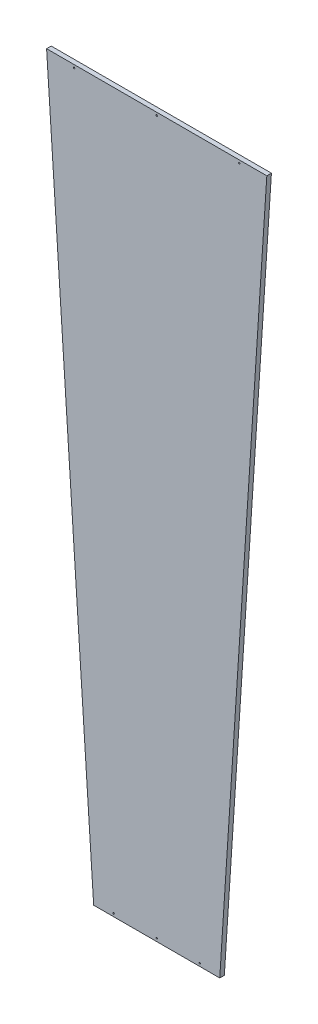
ISO-10303-21;
HEADER;
FILE_DESCRIPTION(('STEP AP214'),'2;1');
FILE_NAME('part.step','',(''),(''),'','','');
FILE_SCHEMA(('AUTOMOTIVE_DESIGN { 1 0 10303 214 1 1 1 1 }'));
ENDSEC;
DATA;
#1=APPLICATION_CONTEXT('core data for automotive mechanical design processes');
#2=APPLICATION_PROTOCOL_DEFINITION('international standard','automotive_design',2000,#1);
#3=PRODUCT_CONTEXT('',#1,'mechanical');
#4=PRODUCT('Part','Part','',(#3));
#5=PRODUCT_RELATED_PRODUCT_CATEGORY('part','',(#4));
#6=PRODUCT_DEFINITION_FORMATION('','',#4);
#7=PRODUCT_DEFINITION_CONTEXT('part definition',#1,'design');
#8=PRODUCT_DEFINITION('design','',#6,#7);
#9=PRODUCT_DEFINITION_SHAPE('','',#8);
#10=(LENGTH_UNIT() NAMED_UNIT(*) SI_UNIT(.MILLI.,.METRE.));
#11=(NAMED_UNIT(*) PLANE_ANGLE_UNIT() SI_UNIT($,.RADIAN.));
#12=(NAMED_UNIT(*) SI_UNIT($,.STERADIAN.) SOLID_ANGLE_UNIT());
#13=UNCERTAINTY_MEASURE_WITH_UNIT(LENGTH_MEASURE(1.E-05),#10,'distance_accuracy_value','');
#14=(GEOMETRIC_REPRESENTATION_CONTEXT(3) GLOBAL_UNCERTAINTY_ASSIGNED_CONTEXT((#13)) GLOBAL_UNIT_ASSIGNED_CONTEXT((#10,
#11,#12)) REPRESENTATION_CONTEXT('',''));
#15=CARTESIAN_POINT('',(0.,0.,0.));
#16=DIRECTION('',(0.,0.,1.));
#17=DIRECTION('',(1.,0.,0.));
#18=AXIS2_PLACEMENT_3D('',#15,#16,#17);
#19=CARTESIAN_POINT('',(-7.66326205582319,93.9841028384047,0.16));
#20=DIRECTION('',(-0.997858923238604,-0.0654031292301395,0.));
#21=DIRECTION('',(0.0654031292301396,-0.997858923238604,0.));
#22=AXIS2_PLACEMENT_3D('',#19,#20,#21);
#23=PLANE('',#22);
#24=DIRECTION('',(-0.0654031292301396,0.997858923238604,0.));
#25=VECTOR('',#24,1.);
#26=CARTESIAN_POINT('',(-7.66326205582319,93.9841028384047,-0.16));
#27=LINE('',#26,#25);
#28=CARTESIAN_POINT('',(-4.38700000000001,43.9980033084047,-0.16));
#29=VERTEX_POINT('',#28);
#30=CARTESIAN_POINT('',(-7.66326205582319,93.9841028384047,-0.16));
#31=VERTEX_POINT('',#30);
#32=EDGE_CURVE('E95',#29,#31,#27,.T.);
#33=ORIENTED_EDGE('',*,*,#32,.F.);
#34=DIRECTION('',(0.,0.,-1.));
#35=VECTOR('',#34,1.);
#36=CARTESIAN_POINT('',(-4.38700000000001,43.9980033084047,0.16));
#37=LINE('',#36,#35);
#38=CARTESIAN_POINT('',(-4.38700000000001,43.9980033084047,0.16));
#39=VERTEX_POINT('',#38);
#40=EDGE_CURVE('E11',#39,#29,#37,.T.);
#41=ORIENTED_EDGE('',*,*,#40,.F.);
#42=DIRECTION('',(-0.0654031292301396,0.997858923238604,0.));
#43=VECTOR('',#42,1.);
#44=CARTESIAN_POINT('',(-7.66326205582319,93.9841028384047,0.16));
#45=LINE('',#44,#43);
#46=CARTESIAN_POINT('',(-7.66326205582319,93.9841028384047,0.16));
#47=VERTEX_POINT('',#46);
#48=EDGE_CURVE('E88',#39,#47,#45,.T.);
#49=ORIENTED_EDGE('',*,*,#48,.T.);
#50=DIRECTION('',(0.,0.,-1.));
#51=VECTOR('',#50,1.);
#52=CARTESIAN_POINT('',(-7.66326205582319,93.9841028384047,0.16));
#53=LINE('',#52,#51);
#54=EDGE_CURVE('E33',#47,#31,#53,.T.);
#55=ORIENTED_EDGE('',*,*,#54,.T.);
#56=EDGE_LOOP('',(#33,#41,#49,#55));
#57=FACE_BOUND('',#56,.T.);
#58=ADVANCED_FACE('F30',(#57),#23,.T.);
#59=CARTESIAN_POINT('',(4.38699999999999,43.9980033084047,0.16));
#60=DIRECTION('',(0.,-1.,0.));
#61=DIRECTION('',(0.,0.,-1.));
#62=AXIS2_PLACEMENT_3D('',#59,#60,#61);
#63=PLANE('',#62);
#64=DIRECTION('',(-1.,0.,0.));
#65=VECTOR('',#64,1.);
#66=CARTESIAN_POINT('',(4.38699999999999,43.9980033084047,-0.16));
#67=LINE('',#66,#65);
#68=CARTESIAN_POINT('',(4.38699999999999,43.9980033084047,-0.16));
#69=VERTEX_POINT('',#68);
#70=EDGE_CURVE('E90',#69,#29,#67,.T.);
#71=ORIENTED_EDGE('',*,*,#70,.F.);
#72=DIRECTION('',(0.,0.,-1.));
#73=VECTOR('',#72,1.);
#74=CARTESIAN_POINT('',(4.38699999999999,43.9980033084047,0.16));
#75=LINE('',#74,#73);
#76=CARTESIAN_POINT('',(4.38699999999999,43.9980033084047,0.16));
#77=VERTEX_POINT('',#76);
#78=EDGE_CURVE('E39',#77,#69,#75,.T.);
#79=ORIENTED_EDGE('',*,*,#78,.F.);
#80=DIRECTION('',(-1.,0.,0.));
#81=VECTOR('',#80,1.);
#82=CARTESIAN_POINT('',(4.38699999999999,43.9980033084047,0.16));
#83=LINE('',#82,#81);
#84=EDGE_CURVE('E85',#77,#39,#83,.T.);
#85=ORIENTED_EDGE('',*,*,#84,.T.);
#86=ORIENTED_EDGE('',*,*,#40,.T.);
#87=EDGE_LOOP('',(#71,#79,#85,#86));
#88=FACE_BOUND('',#87,.T.);
#89=ADVANCED_FACE('F106',(#88),#63,.T.);
#90=CARTESIAN_POINT('',(7.66326205582318,93.9841028384047,0.16));
#91=DIRECTION('',(0.997858923238604,-0.0654031292301398,0.));
#92=DIRECTION('',(0.0654031292301398,0.997858923238604,0.));
#93=AXIS2_PLACEMENT_3D('',#90,#91,#92);
#94=PLANE('',#93);
#95=DIRECTION('',(-0.0654031292301398,-0.997858923238604,0.));
#96=VECTOR('',#95,1.);
#97=CARTESIAN_POINT('',(7.66326205582318,93.9841028384047,-0.16));
#98=LINE('',#97,#96);
#99=CARTESIAN_POINT('',(7.66326205582318,93.9841028384047,-0.16));
#100=VERTEX_POINT('',#99);
#101=EDGE_CURVE('E80',#100,#69,#98,.T.);
#102=ORIENTED_EDGE('',*,*,#101,.F.);
#103=DIRECTION('',(0.,0.,-1.));
#104=VECTOR('',#103,1.);
#105=CARTESIAN_POINT('',(7.66326205582318,93.9841028384047,0.16));
#106=LINE('',#105,#104);
#107=CARTESIAN_POINT('',(7.66326205582318,93.9841028384047,0.16));
#108=VERTEX_POINT('',#107);
#109=EDGE_CURVE('E75',#108,#100,#106,.T.);
#110=ORIENTED_EDGE('',*,*,#109,.F.);
#111=DIRECTION('',(-0.0654031292301398,-0.997858923238604,0.));
#112=VECTOR('',#111,1.);
#113=CARTESIAN_POINT('',(7.66326205582318,93.9841028384047,0.16));
#114=LINE('',#113,#112);
#115=EDGE_CURVE('E78',#108,#77,#114,.T.);
#116=ORIENTED_EDGE('',*,*,#115,.T.);
#117=ORIENTED_EDGE('',*,*,#78,.T.);
#118=EDGE_LOOP('',(#102,#110,#116,#117));
#119=FACE_BOUND('',#118,.T.);
#120=ADVANCED_FACE('F77',(#119),#94,.T.);
#121=CARTESIAN_POINT('',(-7.66326205582319,93.9841028384047,0.16));
#122=DIRECTION('',(0.,1.,0.));
#123=DIRECTION('',(0.,0.,1.));
#124=AXIS2_PLACEMENT_3D('',#121,#122,#123);
#125=PLANE('',#124);
#126=DIRECTION('',(1.,0.,0.));
#127=VECTOR('',#126,1.);
#128=CARTESIAN_POINT('',(-7.66326205582319,93.9841028384047,-0.16));
#129=LINE('',#128,#127);
#130=EDGE_CURVE('E98',#31,#100,#129,.T.);
#131=ORIENTED_EDGE('',*,*,#130,.F.);
#132=ORIENTED_EDGE('',*,*,#54,.F.);
#133=DIRECTION('',(1.,0.,0.));
#134=VECTOR('',#133,1.);
#135=CARTESIAN_POINT('',(-7.66326205582319,93.9841028384047,0.16));
#136=LINE('',#135,#134);
#137=EDGE_CURVE('E84',#47,#108,#136,.T.);
#138=ORIENTED_EDGE('',*,*,#137,.T.);
#139=ORIENTED_EDGE('',*,*,#109,.T.);
#140=EDGE_LOOP('',(#131,#132,#138,#139));
#141=FACE_BOUND('',#140,.T.);
#142=ADVANCED_FACE('F87',(#141),#125,.T.);
#143=CARTESIAN_POINT('',(-7.66326205582319,93.9841028384047,0.16));
#144=DIRECTION('',(0.,0.,1.));
#145=DIRECTION('',(1.,0.,0.));
#146=AXIS2_PLACEMENT_3D('',#143,#144,#145);
#147=PLANE('',#146);
#148=CARTESIAN_POINT('',(5.74639155524786,93.7841028384047,0.16));
#149=DIRECTION('',(0.,0.,1.));
#150=DIRECTION('',(1.,0.,0.));
#151=AXIS2_PLACEMENT_3D('',#148,#149,#150);
#152=CIRCLE('',#151,0.0499999999999898);
#153=CARTESIAN_POINT('',(5.79639155524785,93.7841028384047,0.16));
#154=VERTEX_POINT('',#153);
#155=EDGE_CURVE('E158',#154,#154,#152,.T.);
#156=ORIENTED_EDGE('',*,*,#155,.F.);
#157=EDGE_LOOP('',(#156));
#158=FACE_BOUND('',#157,.T.);
#159=CARTESIAN_POINT('',(0.,93.7841028384047,0.16));
#160=DIRECTION('',(0.,0.,1.));
#161=DIRECTION('',(1.,0.,0.));
#162=AXIS2_PLACEMENT_3D('',#159,#160,#161);
#163=CIRCLE('',#162,0.0499999999999943);
#164=CARTESIAN_POINT('',(0.0499999999999943,93.7841028384047,0.16));
#165=VERTEX_POINT('',#164);
#166=EDGE_CURVE('E160',#165,#165,#163,.T.);
#167=ORIENTED_EDGE('',*,*,#166,.F.);
#168=EDGE_LOOP('',(#167));
#169=FACE_BOUND('',#168,.T.);
#170=CARTESIAN_POINT('',(-5.74639155524786,93.7841028384047,0.16));
#171=DIRECTION('',(0.,0.,1.));
#172=DIRECTION('',(1.,0.,0.));
#173=AXIS2_PLACEMENT_3D('',#170,#171,#172);
#174=CIRCLE('',#173,0.0499999999999898);
#175=CARTESIAN_POINT('',(-5.69639155524787,93.7841028384047,0.16));
#176=VERTEX_POINT('',#175);
#177=EDGE_CURVE('E166',#176,#176,#174,.T.);
#178=ORIENTED_EDGE('',*,*,#177,.F.);
#179=EDGE_LOOP('',(#178));
#180=FACE_BOUND('',#179,.T.);
#181=CARTESIAN_POINT('',(3.,44.1980033084047,0.16));
#182=DIRECTION('',(0.,0.,1.));
#183=DIRECTION('',(1.,0.,0.));
#184=AXIS2_PLACEMENT_3D('',#181,#182,#183);
#185=CIRCLE('',#184,0.050000000000001);
#186=CARTESIAN_POINT('',(3.05,44.1980033084047,0.16));
#187=VERTEX_POINT('',#186);
#188=EDGE_CURVE('E172',#187,#187,#185,.T.);
#189=ORIENTED_EDGE('',*,*,#188,.F.);
#190=EDGE_LOOP('',(#189));
#191=FACE_BOUND('',#190,.T.);
#192=CARTESIAN_POINT('',(0.,44.1980033084047,0.16));
#193=DIRECTION('',(0.,0.,1.));
#194=DIRECTION('',(1.,0.,0.));
#195=AXIS2_PLACEMENT_3D('',#192,#193,#194);
#196=CIRCLE('',#195,0.0500000000000008);
#197=CARTESIAN_POINT('',(0.0500000000000008,44.1980033084047,0.16));
#198=VERTEX_POINT('',#197);
#199=EDGE_CURVE('E178',#198,#198,#196,.T.);
#200=ORIENTED_EDGE('',*,*,#199,.F.);
#201=EDGE_LOOP('',(#200));
#202=FACE_BOUND('',#201,.T.);
#203=CARTESIAN_POINT('',(-3.,44.1980033084047,0.16));
#204=DIRECTION('',(0.,0.,1.));
#205=DIRECTION('',(1.,0.,0.));
#206=AXIS2_PLACEMENT_3D('',#203,#204,#205);
#207=CIRCLE('',#206,0.050000000000001);
#208=CARTESIAN_POINT('',(-2.95,44.1980033084047,0.16));
#209=VERTEX_POINT('',#208);
#210=EDGE_CURVE('E184',#209,#209,#207,.T.);
#211=ORIENTED_EDGE('',*,*,#210,.F.);
#212=EDGE_LOOP('',(#211));
#213=FACE_BOUND('',#212,.T.);
#214=ORIENTED_EDGE('',*,*,#48,.F.);
#215=ORIENTED_EDGE('',*,*,#84,.F.);
#216=ORIENTED_EDGE('',*,*,#115,.F.);
#217=ORIENTED_EDGE('',*,*,#137,.F.);
#218=EDGE_LOOP('',(#214,#215,#216,#217));
#219=FACE_BOUND('',#218,.T.);
#220=ADVANCED_FACE('F83',(#158,#169,#180,#191,#202,#213,#219),#147,.T.);
#221=CARTESIAN_POINT('',(-7.66326205582319,93.9841028384047,-0.16));
#222=DIRECTION('',(0.,0.,1.));
#223=DIRECTION('',(1.,0.,0.));
#224=AXIS2_PLACEMENT_3D('',#221,#222,#223);
#225=PLANE('',#224);
#226=CARTESIAN_POINT('',(5.74639155524786,93.7841028384047,-0.16));
#227=DIRECTION('',(0.,0.,1.));
#228=DIRECTION('',(1.,0.,0.));
#229=AXIS2_PLACEMENT_3D('',#226,#227,#228);
#230=CIRCLE('',#229,0.0499999999999898);
#231=CARTESIAN_POINT('',(5.79639155524785,93.7841028384047,-0.16));
#232=VERTEX_POINT('',#231);
#233=EDGE_CURVE('E156',#232,#232,#230,.T.);
#234=ORIENTED_EDGE('',*,*,#233,.T.);
#235=EDGE_LOOP('',(#234));
#236=FACE_BOUND('',#235,.T.);
#237=CARTESIAN_POINT('',(0.,93.7841028384047,-0.16));
#238=DIRECTION('',(0.,0.,1.));
#239=DIRECTION('',(1.,0.,0.));
#240=AXIS2_PLACEMENT_3D('',#237,#238,#239);
#241=CIRCLE('',#240,0.0499999999999943);
#242=CARTESIAN_POINT('',(0.0499999999999943,93.7841028384047,-0.16));
#243=VERTEX_POINT('',#242);
#244=EDGE_CURVE('E163',#243,#243,#241,.T.);
#245=ORIENTED_EDGE('',*,*,#244,.T.);
#246=EDGE_LOOP('',(#245));
#247=FACE_BOUND('',#246,.T.);
#248=CARTESIAN_POINT('',(-5.74639155524786,93.7841028384047,-0.16));
#249=DIRECTION('',(0.,0.,1.));
#250=DIRECTION('',(1.,0.,0.));
#251=AXIS2_PLACEMENT_3D('',#248,#249,#250);
#252=CIRCLE('',#251,0.0499999999999898);
#253=CARTESIAN_POINT('',(-5.69639155524787,93.7841028384047,-0.16));
#254=VERTEX_POINT('',#253);
#255=EDGE_CURVE('E169',#254,#254,#252,.T.);
#256=ORIENTED_EDGE('',*,*,#255,.T.);
#257=EDGE_LOOP('',(#256));
#258=FACE_BOUND('',#257,.T.);
#259=CARTESIAN_POINT('',(3.,44.1980033084047,-0.16));
#260=DIRECTION('',(0.,0.,1.));
#261=DIRECTION('',(1.,0.,0.));
#262=AXIS2_PLACEMENT_3D('',#259,#260,#261);
#263=CIRCLE('',#262,0.050000000000001);
#264=CARTESIAN_POINT('',(3.05,44.1980033084047,-0.16));
#265=VERTEX_POINT('',#264);
#266=EDGE_CURVE('E175',#265,#265,#263,.T.);
#267=ORIENTED_EDGE('',*,*,#266,.T.);
#268=EDGE_LOOP('',(#267));
#269=FACE_BOUND('',#268,.T.);
#270=CARTESIAN_POINT('',(0.,44.1980033084047,-0.16));
#271=DIRECTION('',(0.,0.,1.));
#272=DIRECTION('',(1.,0.,0.));
#273=AXIS2_PLACEMENT_3D('',#270,#271,#272);
#274=CIRCLE('',#273,0.0500000000000008);
#275=CARTESIAN_POINT('',(0.0500000000000008,44.1980033084047,-0.16));
#276=VERTEX_POINT('',#275);
#277=EDGE_CURVE('E181',#276,#276,#274,.T.);
#278=ORIENTED_EDGE('',*,*,#277,.T.);
#279=EDGE_LOOP('',(#278));
#280=FACE_BOUND('',#279,.T.);
#281=CARTESIAN_POINT('',(-3.,44.1980033084047,-0.16));
#282=DIRECTION('',(0.,0.,1.));
#283=DIRECTION('',(1.,0.,0.));
#284=AXIS2_PLACEMENT_3D('',#281,#282,#283);
#285=CIRCLE('',#284,0.050000000000001);
#286=CARTESIAN_POINT('',(-2.95,44.1980033084047,-0.16));
#287=VERTEX_POINT('',#286);
#288=EDGE_CURVE('E99',#287,#287,#285,.T.);
#289=ORIENTED_EDGE('',*,*,#288,.T.);
#290=EDGE_LOOP('',(#289));
#291=FACE_BOUND('',#290,.T.);
#292=ORIENTED_EDGE('',*,*,#32,.T.);
#293=ORIENTED_EDGE('',*,*,#130,.T.);
#294=ORIENTED_EDGE('',*,*,#101,.T.);
#295=ORIENTED_EDGE('',*,*,#70,.T.);
#296=EDGE_LOOP('',(#292,#293,#294,#295));
#297=FACE_BOUND('',#296,.T.);
#298=ADVANCED_FACE('F105',(#236,#247,#258,#269,#280,#291,#297),#225,.F.);
#299=CARTESIAN_POINT('',(-3.,44.1980033084047,-0.16));
#300=DIRECTION('',(0.,0.,1.));
#301=DIRECTION('',(1.,0.,0.));
#302=AXIS2_PLACEMENT_3D('',#299,#300,#301);
#303=CYLINDRICAL_SURFACE('',#302,0.050000000000001);
#304=ORIENTED_EDGE('',*,*,#288,.F.);
#305=EDGE_LOOP('',(#304));
#306=FACE_BOUND('',#305,.T.);
#307=ORIENTED_EDGE('',*,*,#210,.T.);
#308=EDGE_LOOP('',(#307));
#309=FACE_BOUND('',#308,.T.);
#310=ADVANCED_FACE('F124',(#306,#309),#303,.F.);
#311=CARTESIAN_POINT('',(0.,44.1980033084047,-0.16));
#312=DIRECTION('',(0.,0.,1.));
#313=DIRECTION('',(1.,0.,0.));
#314=AXIS2_PLACEMENT_3D('',#311,#312,#313);
#315=CYLINDRICAL_SURFACE('',#314,0.0500000000000008);
#316=ORIENTED_EDGE('',*,*,#277,.F.);
#317=EDGE_LOOP('',(#316));
#318=FACE_BOUND('',#317,.T.);
#319=ORIENTED_EDGE('',*,*,#199,.T.);
#320=EDGE_LOOP('',(#319));
#321=FACE_BOUND('',#320,.T.);
#322=ADVANCED_FACE('F131',(#318,#321),#315,.F.);
#323=CARTESIAN_POINT('',(3.,44.1980033084047,-0.16));
#324=DIRECTION('',(0.,0.,1.));
#325=DIRECTION('',(1.,0.,0.));
#326=AXIS2_PLACEMENT_3D('',#323,#324,#325);
#327=CYLINDRICAL_SURFACE('',#326,0.050000000000001);
#328=ORIENTED_EDGE('',*,*,#266,.F.);
#329=EDGE_LOOP('',(#328));
#330=FACE_BOUND('',#329,.T.);
#331=ORIENTED_EDGE('',*,*,#188,.T.);
#332=EDGE_LOOP('',(#331));
#333=FACE_BOUND('',#332,.T.);
#334=ADVANCED_FACE('F135',(#330,#333),#327,.F.);
#335=CARTESIAN_POINT('',(-5.74639155524786,93.7841028384047,-0.16));
#336=DIRECTION('',(0.,0.,1.));
#337=DIRECTION('',(1.,0.,0.));
#338=AXIS2_PLACEMENT_3D('',#335,#336,#337);
#339=CYLINDRICAL_SURFACE('',#338,0.0499999999999898);
#340=ORIENTED_EDGE('',*,*,#255,.F.);
#341=EDGE_LOOP('',(#340));
#342=FACE_BOUND('',#341,.T.);
#343=ORIENTED_EDGE('',*,*,#177,.T.);
#344=EDGE_LOOP('',(#343));
#345=FACE_BOUND('',#344,.T.);
#346=ADVANCED_FACE('F139',(#342,#345),#339,.F.);
#347=CARTESIAN_POINT('',(0.,93.7841028384047,-0.16));
#348=DIRECTION('',(0.,0.,1.));
#349=DIRECTION('',(1.,0.,0.));
#350=AXIS2_PLACEMENT_3D('',#347,#348,#349);
#351=CYLINDRICAL_SURFACE('',#350,0.0499999999999943);
#352=ORIENTED_EDGE('',*,*,#244,.F.);
#353=EDGE_LOOP('',(#352));
#354=FACE_BOUND('',#353,.T.);
#355=ORIENTED_EDGE('',*,*,#166,.T.);
#356=EDGE_LOOP('',(#355));
#357=FACE_BOUND('',#356,.T.);
#358=ADVANCED_FACE('F143',(#354,#357),#351,.F.);
#359=CARTESIAN_POINT('',(5.74639155524786,93.7841028384047,-0.16));
#360=DIRECTION('',(0.,0.,1.));
#361=DIRECTION('',(1.,0.,0.));
#362=AXIS2_PLACEMENT_3D('',#359,#360,#361);
#363=CYLINDRICAL_SURFACE('',#362,0.0499999999999898);
#364=ORIENTED_EDGE('',*,*,#233,.F.);
#365=EDGE_LOOP('',(#364));
#366=FACE_BOUND('',#365,.T.);
#367=ORIENTED_EDGE('',*,*,#155,.T.);
#368=EDGE_LOOP('',(#367));
#369=FACE_BOUND('',#368,.T.);
#370=ADVANCED_FACE('F147',(#366,#369),#363,.F.);
#371=CLOSED_SHELL('',(#58,#89,#120,#142,#220,#298,#310,#322,#334,#346,#358,#370));
#372=MANIFOLD_SOLID_BREP('B2',#371);
#373=ADVANCED_BREP_SHAPE_REPRESENTATION('',(#18,#372),#14);
#374=SHAPE_DEFINITION_REPRESENTATION(#9,#373);
ENDSEC;
END-ISO-10303-21;
